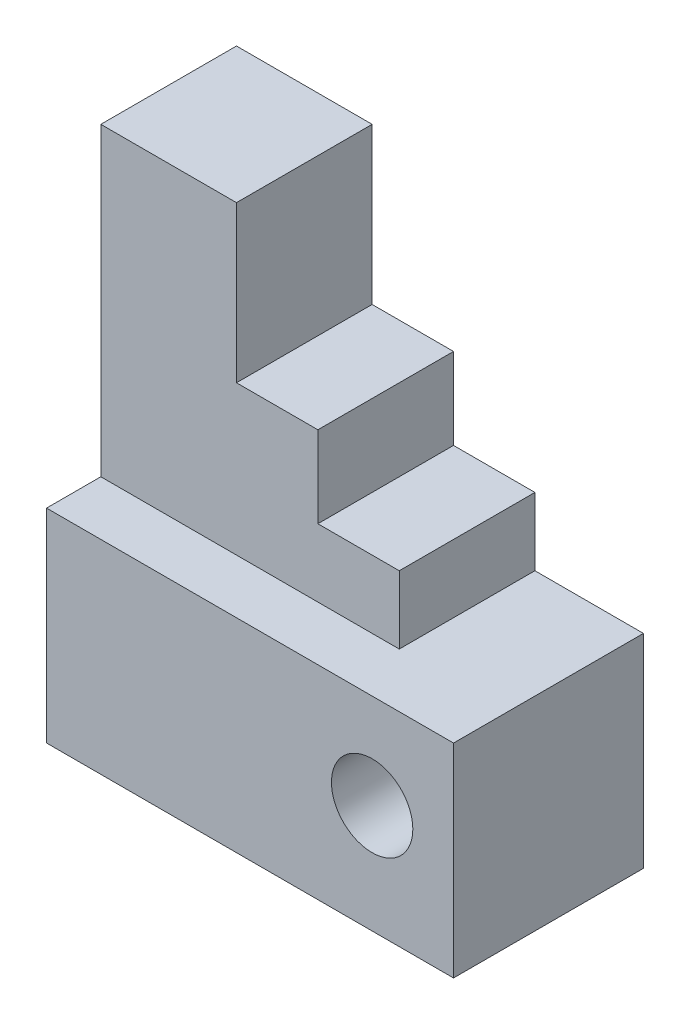
ISO-10303-21;
HEADER;
FILE_DESCRIPTION(('STEP AP214'),'2;1');
FILE_NAME('part.step','',(''),(''),'','','');
FILE_SCHEMA(('AUTOMOTIVE_DESIGN { 1 0 10303 214 1 1 1 1 }'));
ENDSEC;
DATA;
#1=APPLICATION_CONTEXT('core data for automotive mechanical design processes');
#2=APPLICATION_PROTOCOL_DEFINITION('international standard','automotive_design',2000,#1);
#3=PRODUCT_CONTEXT('',#1,'mechanical');
#4=PRODUCT('Part','Part','',(#3));
#5=PRODUCT_RELATED_PRODUCT_CATEGORY('part','',(#4));
#6=PRODUCT_DEFINITION_FORMATION('','',#4);
#7=PRODUCT_DEFINITION_CONTEXT('part definition',#1,'design');
#8=PRODUCT_DEFINITION('design','',#6,#7);
#9=PRODUCT_DEFINITION_SHAPE('','',#8);
#10=(LENGTH_UNIT() NAMED_UNIT(*) SI_UNIT(.MILLI.,.METRE.));
#11=(NAMED_UNIT(*) PLANE_ANGLE_UNIT() SI_UNIT($,.RADIAN.));
#12=(NAMED_UNIT(*) SI_UNIT($,.STERADIAN.) SOLID_ANGLE_UNIT());
#13=UNCERTAINTY_MEASURE_WITH_UNIT(LENGTH_MEASURE(1.E-05),#10,'distance_accuracy_value','');
#14=(GEOMETRIC_REPRESENTATION_CONTEXT(3) GLOBAL_UNCERTAINTY_ASSIGNED_CONTEXT((#13)) GLOBAL_UNIT_ASSIGNED_CONTEXT((#10,
#11,#12)) REPRESENTATION_CONTEXT('',''));
#15=CARTESIAN_POINT('',(0.,0.,0.));
#16=DIRECTION('',(0.,0.,1.));
#17=DIRECTION('',(1.,0.,0.));
#18=AXIS2_PLACEMENT_3D('',#15,#16,#17);
#19=CARTESIAN_POINT('',(44.,0.,20.));
#20=DIRECTION('',(1.,0.,0.));
#21=DIRECTION('',(0.,1.,0.));
#22=AXIS2_PLACEMENT_3D('',#19,#20,#21);
#23=PLANE('',#22);
#24=DIRECTION('',(0.,-1.,0.));
#25=VECTOR('',#24,1.);
#26=CARTESIAN_POINT('',(44.,0.,0.));
#27=LINE('',#26,#25);
#28=CARTESIAN_POINT('',(44.,40.,0.));
#29=VERTEX_POINT('',#28);
#30=CARTESIAN_POINT('',(44.,30.,0.));
#31=VERTEX_POINT('',#30);
#32=EDGE_CURVE('E146',#29,#31,#27,.T.);
#33=ORIENTED_EDGE('',*,*,#32,.F.);
#34=DIRECTION('',(0.,0.,-1.));
#35=VECTOR('',#34,1.);
#36=CARTESIAN_POINT('',(44.,40.,20.));
#37=LINE('',#36,#35);
#38=CARTESIAN_POINT('',(44.,40.,20.));
#39=VERTEX_POINT('',#38);
#40=EDGE_CURVE('E11',#39,#29,#37,.T.);
#41=ORIENTED_EDGE('',*,*,#40,.F.);
#42=DIRECTION('',(0.,-1.,0.));
#43=VECTOR('',#42,1.);
#44=CARTESIAN_POINT('',(44.,0.,20.));
#45=LINE('',#44,#43);
#46=CARTESIAN_POINT('',(44.,30.,20.));
#47=VERTEX_POINT('',#46);
#48=EDGE_CURVE('E172',#39,#47,#45,.T.);
#49=ORIENTED_EDGE('',*,*,#48,.T.);
#50=DIRECTION('',(0.,0.,-1.));
#51=VECTOR('',#50,1.);
#52=CARTESIAN_POINT('',(44.,30.,20.));
#53=LINE('',#52,#51);
#54=EDGE_CURVE('E64',#47,#31,#53,.T.);
#55=ORIENTED_EDGE('',*,*,#54,.T.);
#56=EDGE_LOOP('',(#33,#41,#49,#55));
#57=FACE_BOUND('',#56,.T.);
#58=ADVANCED_FACE('F47',(#57),#23,.T.);
#59=CARTESIAN_POINT('',(0.,40.,20.));
#60=DIRECTION('',(0.,1.,0.));
#61=DIRECTION('',(0.,0.,1.));
#62=AXIS2_PLACEMENT_3D('',#59,#60,#61);
#63=PLANE('',#62);
#64=DIRECTION('',(1.,0.,0.));
#65=VECTOR('',#64,1.);
#66=CARTESIAN_POINT('',(0.,40.,0.));
#67=LINE('',#66,#65);
#68=CARTESIAN_POINT('',(32.,40.,0.));
#69=VERTEX_POINT('',#68);
#70=EDGE_CURVE('E150',#69,#29,#67,.T.);
#71=ORIENTED_EDGE('',*,*,#70,.F.);
#72=DIRECTION('',(0.,0.,-1.));
#73=VECTOR('',#72,1.);
#74=CARTESIAN_POINT('',(32.,40.,20.));
#75=LINE('',#74,#73);
#76=CARTESIAN_POINT('',(32.,40.,20.));
#77=VERTEX_POINT('',#76);
#78=EDGE_CURVE('E56',#77,#69,#75,.T.);
#79=ORIENTED_EDGE('',*,*,#78,.F.);
#80=DIRECTION('',(1.,0.,0.));
#81=VECTOR('',#80,1.);
#82=CARTESIAN_POINT('',(0.,40.,20.));
#83=LINE('',#82,#81);
#84=EDGE_CURVE('E197',#77,#39,#83,.T.);
#85=ORIENTED_EDGE('',*,*,#84,.T.);
#86=ORIENTED_EDGE('',*,*,#40,.T.);
#87=EDGE_LOOP('',(#71,#79,#85,#86));
#88=FACE_BOUND('',#87,.T.);
#89=ADVANCED_FACE('F191',(#88),#63,.T.);
#90=CARTESIAN_POINT('',(32.,0.,20.));
#91=DIRECTION('',(1.,0.,0.));
#92=DIRECTION('',(0.,0.,-1.));
#93=AXIS2_PLACEMENT_3D('',#90,#91,#92);
#94=PLANE('',#93);
#95=DIRECTION('',(0.,-1.,0.));
#96=VECTOR('',#95,1.);
#97=CARTESIAN_POINT('',(32.,0.,0.));
#98=LINE('',#97,#96);
#99=CARTESIAN_POINT('',(32.,52.,0.));
#100=VERTEX_POINT('',#99);
#101=EDGE_CURVE('E155',#100,#69,#98,.T.);
#102=ORIENTED_EDGE('',*,*,#101,.F.);
#103=DIRECTION('',(0.,0.,-1.));
#104=VECTOR('',#103,1.);
#105=CARTESIAN_POINT('',(32.,52.,20.));
#106=LINE('',#105,#104);
#107=CARTESIAN_POINT('',(32.,52.,20.));
#108=VERTEX_POINT('',#107);
#109=EDGE_CURVE('E179',#108,#100,#106,.T.);
#110=ORIENTED_EDGE('',*,*,#109,.F.);
#111=DIRECTION('',(0.,-1.,0.));
#112=VECTOR('',#111,1.);
#113=CARTESIAN_POINT('',(32.,0.,20.));
#114=LINE('',#113,#112);
#115=EDGE_CURVE('E187',#108,#77,#114,.T.);
#116=ORIENTED_EDGE('',*,*,#115,.T.);
#117=ORIENTED_EDGE('',*,*,#78,.T.);
#118=EDGE_LOOP('',(#102,#110,#116,#117));
#119=FACE_BOUND('',#118,.T.);
#120=ADVANCED_FACE('F186',(#119),#94,.T.);
#121=CARTESIAN_POINT('',(0.,52.,20.));
#122=DIRECTION('',(0.,1.,0.));
#123=DIRECTION('',(0.,0.,1.));
#124=AXIS2_PLACEMENT_3D('',#121,#122,#123);
#125=PLANE('',#124);
#126=DIRECTION('',(1.,0.,0.));
#127=VECTOR('',#126,1.);
#128=CARTESIAN_POINT('',(0.,52.,0.));
#129=LINE('',#128,#127);
#130=CARTESIAN_POINT('',(20.,52.,0.));
#131=VERTEX_POINT('',#130);
#132=EDGE_CURVE('E159',#131,#100,#129,.T.);
#133=ORIENTED_EDGE('',*,*,#132,.F.);
#134=DIRECTION('',(0.,0.,-1.));
#135=VECTOR('',#134,1.);
#136=CARTESIAN_POINT('',(20.,52.,20.));
#137=LINE('',#136,#135);
#138=CARTESIAN_POINT('',(20.,52.,20.));
#139=VERTEX_POINT('',#138);
#140=EDGE_CURVE('E122',#139,#131,#137,.T.);
#141=ORIENTED_EDGE('',*,*,#140,.F.);
#142=DIRECTION('',(1.,0.,0.));
#143=VECTOR('',#142,1.);
#144=CARTESIAN_POINT('',(0.,52.,20.));
#145=LINE('',#144,#143);
#146=EDGE_CURVE('E132',#139,#108,#145,.T.);
#147=ORIENTED_EDGE('',*,*,#146,.T.);
#148=ORIENTED_EDGE('',*,*,#109,.T.);
#149=EDGE_LOOP('',(#133,#141,#147,#148));
#150=FACE_BOUND('',#149,.T.);
#151=ADVANCED_FACE('F196',(#150),#125,.T.);
#152=CARTESIAN_POINT('',(20.,0.,20.));
#153=DIRECTION('',(1.,0.,0.));
#154=DIRECTION('',(0.,1.,0.));
#155=AXIS2_PLACEMENT_3D('',#152,#153,#154);
#156=PLANE('',#155);
#157=DIRECTION('',(0.,-1.,0.));
#158=VECTOR('',#157,1.);
#159=CARTESIAN_POINT('',(20.,0.,0.));
#160=LINE('',#159,#158);
#161=CARTESIAN_POINT('',(20.,75.,0.));
#162=VERTEX_POINT('',#161);
#163=EDGE_CURVE('E119',#162,#131,#160,.T.);
#164=ORIENTED_EDGE('',*,*,#163,.F.);
#165=DIRECTION('',(0.,0.,-1.));
#166=VECTOR('',#165,1.);
#167=CARTESIAN_POINT('',(20.,75.,20.));
#168=LINE('',#167,#166);
#169=CARTESIAN_POINT('',(20.,75.,20.));
#170=VERTEX_POINT('',#169);
#171=EDGE_CURVE('E88',#170,#162,#168,.T.);
#172=ORIENTED_EDGE('',*,*,#171,.F.);
#173=DIRECTION('',(0.,-1.,0.));
#174=VECTOR('',#173,1.);
#175=CARTESIAN_POINT('',(20.,0.,20.));
#176=LINE('',#175,#174);
#177=EDGE_CURVE('E117',#170,#139,#176,.T.);
#178=ORIENTED_EDGE('',*,*,#177,.T.);
#179=ORIENTED_EDGE('',*,*,#140,.T.);
#180=EDGE_LOOP('',(#164,#172,#178,#179));
#181=FACE_BOUND('',#180,.T.);
#182=ADVANCED_FACE('F116',(#181),#156,.T.);
#183=CARTESIAN_POINT('',(0.,75.,20.));
#184=DIRECTION('',(0.,1.,0.));
#185=DIRECTION('',(0.,0.,1.));
#186=AXIS2_PLACEMENT_3D('',#183,#184,#185);
#187=PLANE('',#186);
#188=DIRECTION('',(1.,0.,0.));
#189=VECTOR('',#188,1.);
#190=CARTESIAN_POINT('',(0.,75.,0.));
#191=LINE('',#190,#189);
#192=CARTESIAN_POINT('',(0.,75.,0.));
#193=VERTEX_POINT('',#192);
#194=EDGE_CURVE('E165',#193,#162,#191,.T.);
#195=ORIENTED_EDGE('',*,*,#194,.F.);
#196=DIRECTION('',(0.,0.,-1.));
#197=VECTOR('',#196,1.);
#198=CARTESIAN_POINT('',(0.,75.,20.));
#199=LINE('',#198,#197);
#200=CARTESIAN_POINT('',(0.,75.,20.));
#201=VERTEX_POINT('',#200);
#202=EDGE_CURVE('E95',#201,#193,#199,.T.);
#203=ORIENTED_EDGE('',*,*,#202,.F.);
#204=DIRECTION('',(1.,0.,0.));
#205=VECTOR('',#204,1.);
#206=CARTESIAN_POINT('',(0.,75.,20.));
#207=LINE('',#206,#205);
#208=EDGE_CURVE('E129',#201,#170,#207,.T.);
#209=ORIENTED_EDGE('',*,*,#208,.T.);
#210=ORIENTED_EDGE('',*,*,#171,.T.);
#211=EDGE_LOOP('',(#195,#203,#209,#210));
#212=FACE_BOUND('',#211,.T.);
#213=ADVANCED_FACE('F135',(#212),#187,.T.);
#214=CARTESIAN_POINT('',(0.,0.,20.));
#215=DIRECTION('',(-1.,0.,0.));
#216=DIRECTION('',(0.,0.,1.));
#217=AXIS2_PLACEMENT_3D('',#214,#215,#216);
#218=PLANE('',#217);
#219=DIRECTION('',(0.,1.,0.));
#220=VECTOR('',#219,1.);
#221=CARTESIAN_POINT('',(0.,0.,0.));
#222=LINE('',#221,#220);
#223=CARTESIAN_POINT('',(0.,0.,0.));
#224=VERTEX_POINT('',#223);
#225=EDGE_CURVE('E168',#224,#193,#222,.T.);
#226=ORIENTED_EDGE('',*,*,#225,.F.);
#227=DIRECTION('',(0.,0.,-1.));
#228=VECTOR('',#227,1.);
#229=CARTESIAN_POINT('',(0.,0.,28.));
#230=LINE('',#229,#228);
#231=CARTESIAN_POINT('',(0.,0.,28.));
#232=VERTEX_POINT('',#231);
#233=EDGE_CURVE('E151',#232,#224,#230,.T.);
#234=ORIENTED_EDGE('',*,*,#233,.F.);
#235=DIRECTION('',(0.,1.,0.));
#236=VECTOR('',#235,1.);
#237=CARTESIAN_POINT('',(0.,0.,28.));
#238=LINE('',#237,#236);
#239=CARTESIAN_POINT('',(0.,30.,28.));
#240=VERTEX_POINT('',#239);
#241=EDGE_CURVE('E226',#232,#240,#238,.T.);
#242=ORIENTED_EDGE('',*,*,#241,.T.);
#243=DIRECTION('',(0.,0.,-1.));
#244=VECTOR('',#243,1.);
#245=CARTESIAN_POINT('',(0.,30.,28.));
#246=LINE('',#245,#244);
#247=CARTESIAN_POINT('',(0.,30.,20.));
#248=VERTEX_POINT('',#247);
#249=EDGE_CURVE('E206',#240,#248,#246,.T.);
#250=ORIENTED_EDGE('',*,*,#249,.T.);
#251=DIRECTION('',(0.,1.,0.));
#252=VECTOR('',#251,1.);
#253=CARTESIAN_POINT('',(0.,0.,20.));
#254=LINE('',#253,#252);
#255=EDGE_CURVE('E137',#248,#201,#254,.T.);
#256=ORIENTED_EDGE('',*,*,#255,.T.);
#257=ORIENTED_EDGE('',*,*,#202,.T.);
#258=EDGE_LOOP('',(#226,#234,#242,#250,#256,#257));
#259=FACE_BOUND('',#258,.T.);
#260=ADVANCED_FACE('F296',(#259),#218,.T.);
#261=CARTESIAN_POINT('',(0.,0.,20.));
#262=DIRECTION('',(0.,0.,1.));
#263=DIRECTION('',(1.,0.,0.));
#264=AXIS2_PLACEMENT_3D('',#261,#262,#263);
#265=PLANE('',#264);
#266=ORIENTED_EDGE('',*,*,#48,.F.);
#267=ORIENTED_EDGE('',*,*,#84,.F.);
#268=ORIENTED_EDGE('',*,*,#115,.F.);
#269=ORIENTED_EDGE('',*,*,#146,.F.);
#270=ORIENTED_EDGE('',*,*,#177,.F.);
#271=ORIENTED_EDGE('',*,*,#208,.F.);
#272=ORIENTED_EDGE('',*,*,#255,.F.);
#273=DIRECTION('',(1.,0.,0.));
#274=VECTOR('',#273,1.);
#275=CARTESIAN_POINT('',(0.,30.,20.));
#276=LINE('',#275,#274);
#277=EDGE_CURVE('E140',#248,#47,#276,.T.);
#278=ORIENTED_EDGE('',*,*,#277,.T.);
#279=EDGE_LOOP('',(#266,#267,#268,#269,#270,#271,#272,#278));
#280=FACE_BOUND('',#279,.T.);
#281=ADVANCED_FACE('F127',(#280),#265,.T.);
#282=CARTESIAN_POINT('',(0.,0.,0.));
#283=DIRECTION('',(0.,0.,1.));
#284=DIRECTION('',(1.,0.,0.));
#285=AXIS2_PLACEMENT_3D('',#282,#283,#284);
#286=PLANE('',#285);
#287=CARTESIAN_POINT('',(48.,16.,0.));
#288=DIRECTION('',(0.,0.,1.));
#289=DIRECTION('',(1.,0.,0.));
#290=AXIS2_PLACEMENT_3D('',#287,#288,#289);
#291=CIRCLE('',#290,6.);
#292=CARTESIAN_POINT('',(54.,16.,0.));
#293=VERTEX_POINT('',#292);
#294=EDGE_CURVE('E235',#293,#293,#291,.T.);
#295=ORIENTED_EDGE('',*,*,#294,.T.);
#296=EDGE_LOOP('',(#295));
#297=FACE_BOUND('',#296,.T.);
#298=ORIENTED_EDGE('',*,*,#32,.T.);
#299=DIRECTION('',(1.,0.,0.));
#300=VECTOR('',#299,1.);
#301=CARTESIAN_POINT('',(0.,30.,0.));
#302=LINE('',#301,#300);
#303=CARTESIAN_POINT('',(60.,30.,0.));
#304=VERTEX_POINT('',#303);
#305=EDGE_CURVE('E231',#31,#304,#302,.T.);
#306=ORIENTED_EDGE('',*,*,#305,.T.);
#307=DIRECTION('',(0.,-1.,0.));
#308=VECTOR('',#307,1.);
#309=CARTESIAN_POINT('',(60.,0.,0.));
#310=LINE('',#309,#308);
#311=CARTESIAN_POINT('',(60.,0.,0.));
#312=VERTEX_POINT('',#311);
#313=EDGE_CURVE('E227',#304,#312,#310,.T.);
#314=ORIENTED_EDGE('',*,*,#313,.T.);
#315=DIRECTION('',(-1.,0.,0.));
#316=VECTOR('',#315,1.);
#317=CARTESIAN_POINT('',(0.,0.,0.));
#318=LINE('',#317,#316);
#319=EDGE_CURVE('E222',#312,#224,#318,.T.);
#320=ORIENTED_EDGE('',*,*,#319,.T.);
#321=ORIENTED_EDGE('',*,*,#225,.T.);
#322=ORIENTED_EDGE('',*,*,#194,.T.);
#323=ORIENTED_EDGE('',*,*,#163,.T.);
#324=ORIENTED_EDGE('',*,*,#132,.T.);
#325=ORIENTED_EDGE('',*,*,#101,.T.);
#326=ORIENTED_EDGE('',*,*,#70,.T.);
#327=EDGE_LOOP('',(#298,#306,#314,#320,#321,#322,#323,#324,#325,#326));
#328=FACE_BOUND('',#327,.T.);
#329=ADVANCED_FACE('F193',(#297,#328),#286,.F.);
#330=CARTESIAN_POINT('',(0.,30.,28.));
#331=DIRECTION('',(0.,1.,0.));
#332=DIRECTION('',(-1.,0.,0.));
#333=AXIS2_PLACEMENT_3D('',#330,#331,#332);
#334=PLANE('',#333);
#335=ORIENTED_EDGE('',*,*,#54,.F.);
#336=ORIENTED_EDGE('',*,*,#277,.F.);
#337=ORIENTED_EDGE('',*,*,#249,.F.);
#338=DIRECTION('',(1.,0.,0.));
#339=VECTOR('',#338,1.);
#340=CARTESIAN_POINT('',(0.,30.,28.));
#341=LINE('',#340,#339);
#342=CARTESIAN_POINT('',(60.,30.,28.));
#343=VERTEX_POINT('',#342);
#344=EDGE_CURVE('E243',#240,#343,#341,.T.);
#345=ORIENTED_EDGE('',*,*,#344,.T.);
#346=DIRECTION('',(0.,0.,-1.));
#347=VECTOR('',#346,1.);
#348=CARTESIAN_POINT('',(60.,30.,28.));
#349=LINE('',#348,#347);
#350=EDGE_CURVE('E210',#343,#304,#349,.T.);
#351=ORIENTED_EDGE('',*,*,#350,.T.);
#352=ORIENTED_EDGE('',*,*,#305,.F.);
#353=EDGE_LOOP('',(#335,#336,#337,#345,#351,#352));
#354=FACE_BOUND('',#353,.T.);
#355=ADVANCED_FACE('F293',(#354),#334,.T.);
#356=CARTESIAN_POINT('',(0.,0.,28.));
#357=DIRECTION('',(0.,-1.,0.));
#358=DIRECTION('',(1.,0.,0.));
#359=AXIS2_PLACEMENT_3D('',#356,#357,#358);
#360=PLANE('',#359);
#361=ORIENTED_EDGE('',*,*,#319,.F.);
#362=DIRECTION('',(0.,0.,-1.));
#363=VECTOR('',#362,1.);
#364=CARTESIAN_POINT('',(60.,0.,28.));
#365=LINE('',#364,#363);
#366=CARTESIAN_POINT('',(60.,0.,28.));
#367=VERTEX_POINT('',#366);
#368=EDGE_CURVE('E215',#367,#312,#365,.T.);
#369=ORIENTED_EDGE('',*,*,#368,.F.);
#370=DIRECTION('',(-1.,0.,0.));
#371=VECTOR('',#370,1.);
#372=CARTESIAN_POINT('',(0.,0.,28.));
#373=LINE('',#372,#371);
#374=EDGE_CURVE('E211',#367,#232,#373,.T.);
#375=ORIENTED_EDGE('',*,*,#374,.T.);
#376=ORIENTED_EDGE('',*,*,#233,.T.);
#377=EDGE_LOOP('',(#361,#369,#375,#376));
#378=FACE_BOUND('',#377,.T.);
#379=ADVANCED_FACE('F283',(#378),#360,.T.);
#380=CARTESIAN_POINT('',(60.,0.,28.));
#381=DIRECTION('',(1.,0.,0.));
#382=DIRECTION('',(0.,0.,-1.));
#383=AXIS2_PLACEMENT_3D('',#380,#381,#382);
#384=PLANE('',#383);
#385=ORIENTED_EDGE('',*,*,#313,.F.);
#386=ORIENTED_EDGE('',*,*,#350,.F.);
#387=DIRECTION('',(0.,-1.,0.));
#388=VECTOR('',#387,1.);
#389=CARTESIAN_POINT('',(60.,0.,28.));
#390=LINE('',#389,#388);
#391=EDGE_CURVE('E239',#343,#367,#390,.T.);
#392=ORIENTED_EDGE('',*,*,#391,.T.);
#393=ORIENTED_EDGE('',*,*,#368,.T.);
#394=EDGE_LOOP('',(#385,#386,#392,#393));
#395=FACE_BOUND('',#394,.T.);
#396=ADVANCED_FACE('F268',(#395),#384,.T.);
#397=CARTESIAN_POINT('',(0.,0.,28.));
#398=DIRECTION('',(0.,0.,-1.));
#399=DIRECTION('',(-1.,0.,0.));
#400=AXIS2_PLACEMENT_3D('',#397,#398,#399);
#401=PLANE('',#400);
#402=CARTESIAN_POINT('',(48.,16.,28.));
#403=DIRECTION('',(0.,0.,1.));
#404=DIRECTION('',(1.,0.,0.));
#405=AXIS2_PLACEMENT_3D('',#402,#403,#404);
#406=CIRCLE('',#405,6.);
#407=CARTESIAN_POINT('',(54.,16.,28.));
#408=VERTEX_POINT('',#407);
#409=EDGE_CURVE('E250',#408,#408,#406,.T.);
#410=ORIENTED_EDGE('',*,*,#409,.F.);
#411=EDGE_LOOP('',(#410));
#412=FACE_BOUND('',#411,.T.);
#413=ORIENTED_EDGE('',*,*,#241,.F.);
#414=ORIENTED_EDGE('',*,*,#374,.F.);
#415=ORIENTED_EDGE('',*,*,#391,.F.);
#416=ORIENTED_EDGE('',*,*,#344,.F.);
#417=EDGE_LOOP('',(#413,#414,#415,#416));
#418=FACE_BOUND('',#417,.T.);
#419=ADVANCED_FACE('F262',(#412,#418),#401,.F.);
#420=CARTESIAN_POINT('',(48.,16.,0.));
#421=DIRECTION('',(0.,0.,1.));
#422=DIRECTION('',(1.,0.,0.));
#423=AXIS2_PLACEMENT_3D('',#420,#421,#422);
#424=CYLINDRICAL_SURFACE('',#423,6.);
#425=ORIENTED_EDGE('',*,*,#294,.F.);
#426=EDGE_LOOP('',(#425));
#427=FACE_BOUND('',#426,.T.);
#428=ORIENTED_EDGE('',*,*,#409,.T.);
#429=EDGE_LOOP('',(#428));
#430=FACE_BOUND('',#429,.T.);
#431=ADVANCED_FACE('F259',(#427,#430),#424,.F.);
#432=CLOSED_SHELL('',(#58,#89,#120,#151,#182,#213,#260,#281,#329,#355,#379,#396,#419,#431));
#433=MANIFOLD_SOLID_BREP('B2',#432);
#434=ADVANCED_BREP_SHAPE_REPRESENTATION('',(#18,#433),#14);
#435=SHAPE_DEFINITION_REPRESENTATION(#9,#434);
ENDSEC;
END-ISO-10303-21;
